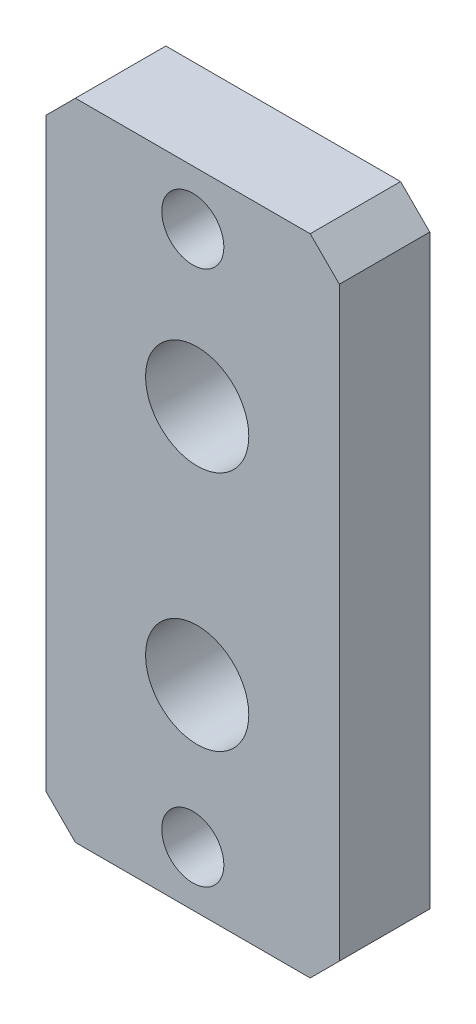
ISO-10303-21;
HEADER;
FILE_DESCRIPTION(('STEP AP214'),'2;1');
FILE_NAME('part.step','',(''),(''),'','','');
FILE_SCHEMA(('AUTOMOTIVE_DESIGN { 1 0 10303 214 1 1 1 1 }'));
ENDSEC;
DATA;
#1=APPLICATION_CONTEXT('core data for automotive mechanical design processes');
#2=APPLICATION_PROTOCOL_DEFINITION('international standard','automotive_design',2000,#1);
#3=PRODUCT_CONTEXT('',#1,'mechanical');
#4=PRODUCT('Part','Part','',(#3));
#5=PRODUCT_RELATED_PRODUCT_CATEGORY('part','',(#4));
#6=PRODUCT_DEFINITION_FORMATION('','',#4);
#7=PRODUCT_DEFINITION_CONTEXT('part definition',#1,'design');
#8=PRODUCT_DEFINITION('design','',#6,#7);
#9=PRODUCT_DEFINITION_SHAPE('','',#8);
#10=(LENGTH_UNIT() NAMED_UNIT(*) SI_UNIT(.MILLI.,.METRE.));
#11=(NAMED_UNIT(*) PLANE_ANGLE_UNIT() SI_UNIT($,.RADIAN.));
#12=(NAMED_UNIT(*) SI_UNIT($,.STERADIAN.) SOLID_ANGLE_UNIT());
#13=UNCERTAINTY_MEASURE_WITH_UNIT(LENGTH_MEASURE(1.E-05),#10,'distance_accuracy_value','');
#14=(GEOMETRIC_REPRESENTATION_CONTEXT(3) GLOBAL_UNCERTAINTY_ASSIGNED_CONTEXT((#13)) GLOBAL_UNIT_ASSIGNED_CONTEXT((#10,
#11,#12)) REPRESENTATION_CONTEXT('',''));
#15=CARTESIAN_POINT('',(0.,0.,0.));
#16=DIRECTION('',(0.,0.,1.));
#17=DIRECTION('',(1.,0.,0.));
#18=AXIS2_PLACEMENT_3D('',#15,#16,#17);
#19=CARTESIAN_POINT('',(0.,0.,0.));
#20=DIRECTION('',(0.,0.,1.));
#21=DIRECTION('',(1.,0.,0.));
#22=AXIS2_PLACEMENT_3D('',#19,#20,#21);
#23=PLANE('',#22);
#24=CARTESIAN_POINT('',(-14.4791443507042,46.9403076965016,0.));
#25=DIRECTION('',(0.,0.,-1.));
#26=DIRECTION('',(-1.,0.,0.));
#27=AXIS2_PLACEMENT_3D('',#24,#25,#26);
#28=CIRCLE('',#27,2.24789999999999);
#29=CARTESIAN_POINT('',(-16.7270443507042,46.9403076965016,0.));
#30=VERTEX_POINT('',#29);
#31=EDGE_CURVE('E366',#30,#30,#28,.T.);
#32=ORIENTED_EDGE('',*,*,#31,.F.);
#33=EDGE_LOOP('',(#32));
#34=FACE_BOUND('',#33,.T.);
#35=DIRECTION('',(0.,1.,0.));
#36=VECTOR('',#35,1.);
#37=CARTESIAN_POINT('',(-9.0498943507042,33.1156969127037,0.));
#38=LINE('',#37,#36);
#39=CARTESIAN_POINT('',(-9.0498943507042,33.1156969127037,0.));
#40=VERTEX_POINT('',#39);
#41=CARTESIAN_POINT('',(-9.0498943507042,50.6416969127035,0.));
#42=VERTEX_POINT('',#41);
#43=EDGE_CURVE('E148',#40,#42,#38,.T.);
#44=ORIENTED_EDGE('',*,*,#43,.F.);
#45=CARTESIAN_POINT('',(-9.5578943507042,33.1156969127037,0.));
#46=DIRECTION('',(0.,0.,1.));
#47=DIRECTION('',(1.,0.,0.));
#48=AXIS2_PLACEMENT_3D('',#45,#46,#47);
#49=CIRCLE('',#48,0.507999999999998);
#50=CARTESIAN_POINT('',(-9.5578943507042,32.6076969127037,0.));
#51=VERTEX_POINT('',#50);
#52=EDGE_CURVE('E168',#51,#40,#49,.T.);
#53=ORIENTED_EDGE('',*,*,#52,.F.);
#54=DIRECTION('',(1.,0.,0.));
#55=VECTOR('',#54,1.);
#56=CARTESIAN_POINT('',(-19.7813943507042,32.6076969127037,0.));
#57=LINE('',#56,#55);
#58=CARTESIAN_POINT('',(-19.7813943507042,32.6076969127037,0.));
#59=VERTEX_POINT('',#58);
#60=EDGE_CURVE('E184',#59,#51,#57,.T.);
#61=ORIENTED_EDGE('',*,*,#60,.F.);
#62=CARTESIAN_POINT('',(-19.7813943507042,33.1156969127037,0.));
#63=DIRECTION('',(0.,0.,1.));
#64=DIRECTION('',(1.,0.,0.));
#65=AXIS2_PLACEMENT_3D('',#62,#63,#64);
#66=CIRCLE('',#65,0.508000000000002);
#67=CARTESIAN_POINT('',(-20.2893943507042,33.1156969127037,0.));
#68=VERTEX_POINT('',#67);
#69=EDGE_CURVE('E181',#68,#59,#66,.T.);
#70=ORIENTED_EDGE('',*,*,#69,.F.);
#71=DIRECTION('',(0.,-1.,0.));
#72=VECTOR('',#71,1.);
#73=CARTESIAN_POINT('',(-20.2893943507042,50.6416969127035,0.));
#74=LINE('',#73,#72);
#75=CARTESIAN_POINT('',(-20.2893943507042,50.6416969127035,0.));
#76=VERTEX_POINT('',#75);
#77=EDGE_CURVE('E178',#76,#68,#74,.T.);
#78=ORIENTED_EDGE('',*,*,#77,.F.);
#79=CARTESIAN_POINT('',(-19.7813943507042,50.6416969127035,0.));
#80=DIRECTION('',(0.,0.,1.));
#81=DIRECTION('',(1.,0.,0.));
#82=AXIS2_PLACEMENT_3D('',#79,#80,#81);
#83=CIRCLE('',#82,0.507999999999996);
#84=CARTESIAN_POINT('',(-19.7813943507042,51.1496969127035,0.));
#85=VERTEX_POINT('',#84);
#86=EDGE_CURVE('E175',#85,#76,#83,.T.);
#87=ORIENTED_EDGE('',*,*,#86,.F.);
#88=DIRECTION('',(-1.,0.,0.));
#89=VECTOR('',#88,1.);
#90=CARTESIAN_POINT('',(-9.5578943507042,51.1496969127035,0.));
#91=LINE('',#90,#89);
#92=CARTESIAN_POINT('',(-9.5578943507042,51.1496969127035,0.));
#93=VERTEX_POINT('',#92);
#94=EDGE_CURVE('E151',#93,#85,#91,.T.);
#95=ORIENTED_EDGE('',*,*,#94,.F.);
#96=CARTESIAN_POINT('',(-9.5578943507042,50.6416969127035,0.));
#97=DIRECTION('',(0.,0.,1.));
#98=DIRECTION('',(1.,0.,0.));
#99=AXIS2_PLACEMENT_3D('',#96,#97,#98);
#100=CIRCLE('',#99,0.508000000000001);
#101=EDGE_CURVE('E144',#42,#93,#100,.T.);
#102=ORIENTED_EDGE('',*,*,#101,.F.);
#103=EDGE_LOOP('',(#44,#53,#61,#70,#78,#87,#95,#102));
#104=FACE_BOUND('',#103,.T.);
#105=CARTESIAN_POINT('',(-14.4791443507042,36.4360861289058,0.));
#106=DIRECTION('',(0.,0.,-1.));
#107=DIRECTION('',(-1.,0.,0.));
#108=AXIS2_PLACEMENT_3D('',#105,#106,#107);
#109=CIRCLE('',#108,2.24789999999999);
#110=CARTESIAN_POINT('',(-16.7270443507042,36.4360861289058,0.));
#111=VERTEX_POINT('',#110);
#112=EDGE_CURVE('E362',#111,#111,#109,.T.);
#113=ORIENTED_EDGE('',*,*,#112,.F.);
#114=EDGE_LOOP('',(#113));
#115=FACE_BOUND('',#114,.T.);
#116=ADVANCED_FACE('F32',(#34,#104,#115),#23,.F.);
#117=CARTESIAN_POINT('',(-8.2878943507042,27.8451969127037,-0.762));
#118=DIRECTION('',(1.,0.,0.));
#119=DIRECTION('',(0.,1.,0.));
#120=AXIS2_PLACEMENT_3D('',#117,#118,#119);
#121=PLANE('',#120);
#122=DIRECTION('',(0.,1.,0.));
#123=VECTOR('',#122,1.);
#124=CARTESIAN_POINT('',(-8.2878943507042,27.8451969127037,-0.762));
#125=LINE('',#124,#123);
#126=CARTESIAN_POINT('',(-8.2878943507042,29.1151969127037,-0.762));
#127=VERTEX_POINT('',#126);
#128=CARTESIAN_POINT('',(-8.2878943507042,54.6421974914117,-0.762));
#129=VERTEX_POINT('',#128);
#130=EDGE_CURVE('E191',#127,#129,#125,.T.);
#131=ORIENTED_EDGE('',*,*,#130,.T.);
#132=DIRECTION('',(0.,0.,1.));
#133=VECTOR('',#132,1.);
#134=CARTESIAN_POINT('',(-8.2878943507042,54.6421974914117,-0.762));
#135=LINE('',#134,#133);
#136=CARTESIAN_POINT('',(-8.2878943507042,54.6421974914117,3.175));
#137=VERTEX_POINT('',#136);
#138=EDGE_CURVE('E244',#129,#137,#135,.T.);
#139=ORIENTED_EDGE('',*,*,#138,.T.);
#140=DIRECTION('',(0.,1.,0.));
#141=VECTOR('',#140,1.);
#142=CARTESIAN_POINT('',(-8.2878943507042,27.8451969127037,3.175));
#143=LINE('',#142,#141);
#144=CARTESIAN_POINT('',(-8.2878943507042,29.1151969127037,3.175));
#145=VERTEX_POINT('',#144);
#146=EDGE_CURVE('E258',#145,#137,#143,.T.);
#147=ORIENTED_EDGE('',*,*,#146,.F.);
#148=DIRECTION('',(0.,0.,-1.));
#149=VECTOR('',#148,1.);
#150=CARTESIAN_POINT('',(-8.2878943507042,29.1151969127037,-0.762));
#151=LINE('',#150,#149);
#152=EDGE_CURVE('E242',#145,#127,#151,.T.);
#153=ORIENTED_EDGE('',*,*,#152,.T.);
#154=EDGE_LOOP('',(#131,#139,#147,#153));
#155=FACE_BOUND('',#154,.T.);
#156=ADVANCED_FACE('F316',(#155),#121,.T.);
#157=CARTESIAN_POINT('',(-21.0513943507042,27.8451969127037,-0.762));
#158=DIRECTION('',(0.,-1.,0.));
#159=DIRECTION('',(0.,0.,-1.));
#160=AXIS2_PLACEMENT_3D('',#157,#158,#159);
#161=PLANE('',#160);
#162=DIRECTION('',(1.,0.,0.));
#163=VECTOR('',#162,1.);
#164=CARTESIAN_POINT('',(-21.0513943507042,27.8451969127037,3.175));
#165=LINE('',#164,#163);
#166=CARTESIAN_POINT('',(-19.7813943507042,27.8451969127037,3.175));
#167=VERTEX_POINT('',#166);
#168=CARTESIAN_POINT('',(-9.5578943507042,27.8451969127037,3.175));
#169=VERTEX_POINT('',#168);
#170=EDGE_CURVE('E250',#167,#169,#165,.T.);
#171=ORIENTED_EDGE('',*,*,#170,.F.);
#172=DIRECTION('',(0.,0.,-1.));
#173=VECTOR('',#172,1.);
#174=CARTESIAN_POINT('',(-19.7813943507042,27.8451969127037,-0.762));
#175=LINE('',#174,#173);
#176=CARTESIAN_POINT('',(-19.7813943507042,27.8451969127037,-0.762));
#177=VERTEX_POINT('',#176);
#178=EDGE_CURVE('E11',#167,#177,#175,.T.);
#179=ORIENTED_EDGE('',*,*,#178,.T.);
#180=DIRECTION('',(1.,0.,0.));
#181=VECTOR('',#180,1.);
#182=CARTESIAN_POINT('',(-21.0513943507042,27.8451969127037,-0.762));
#183=LINE('',#182,#181);
#184=CARTESIAN_POINT('',(-9.5578943507042,27.8451969127037,-0.762));
#185=VERTEX_POINT('',#184);
#186=EDGE_CURVE('E215',#177,#185,#183,.T.);
#187=ORIENTED_EDGE('',*,*,#186,.T.);
#188=DIRECTION('',(0.,0.,1.));
#189=VECTOR('',#188,1.);
#190=CARTESIAN_POINT('',(-9.5578943507042,27.8451969127037,-0.762));
#191=LINE('',#190,#189);
#192=EDGE_CURVE('E40',#185,#169,#191,.T.);
#193=ORIENTED_EDGE('',*,*,#192,.T.);
#194=EDGE_LOOP('',(#171,#179,#187,#193));
#195=FACE_BOUND('',#194,.T.);
#196=ADVANCED_FACE('F249',(#195),#161,.T.);
#197=CARTESIAN_POINT('',(-21.0513943507042,27.8451969127037,-0.762));
#198=DIRECTION('',(-1.,0.,0.));
#199=DIRECTION('',(0.,0.,1.));
#200=AXIS2_PLACEMENT_3D('',#197,#198,#199);
#201=PLANE('',#200);
#202=DIRECTION('',(0.,-1.,0.));
#203=VECTOR('',#202,1.);
#204=CARTESIAN_POINT('',(-21.0513943507042,55.9121974914117,3.175));
#205=LINE('',#204,#203);
#206=CARTESIAN_POINT('',(-21.0513943507042,54.6421974914117,3.175));
#207=VERTEX_POINT('',#206);
#208=CARTESIAN_POINT('',(-21.0513943507042,29.1151969127037,3.175));
#209=VERTEX_POINT('',#208);
#210=EDGE_CURVE('E170',#207,#209,#205,.T.);
#211=ORIENTED_EDGE('',*,*,#210,.F.);
#212=DIRECTION('',(0.,0.,-1.));
#213=VECTOR('',#212,1.);
#214=CARTESIAN_POINT('',(-21.0513943507042,54.6421974914117,-0.762));
#215=LINE('',#214,#213);
#216=CARTESIAN_POINT('',(-21.0513943507042,54.6421974914117,-0.762));
#217=VERTEX_POINT('',#216);
#218=EDGE_CURVE('E233',#207,#217,#215,.T.);
#219=ORIENTED_EDGE('',*,*,#218,.T.);
#220=DIRECTION('',(0.,-1.,0.));
#221=VECTOR('',#220,1.);
#222=CARTESIAN_POINT('',(-21.0513943507042,27.8451969127037,-0.762));
#223=LINE('',#222,#221);
#224=CARTESIAN_POINT('',(-21.0513943507042,29.1151969127037,-0.762));
#225=VERTEX_POINT('',#224);
#226=EDGE_CURVE('E212',#217,#225,#223,.T.);
#227=ORIENTED_EDGE('',*,*,#226,.T.);
#228=DIRECTION('',(0.,0.,1.));
#229=VECTOR('',#228,1.);
#230=CARTESIAN_POINT('',(-21.0513943507042,29.1151969127037,-0.762));
#231=LINE('',#230,#229);
#232=EDGE_CURVE('E230',#225,#209,#231,.T.);
#233=ORIENTED_EDGE('',*,*,#232,.T.);
#234=EDGE_LOOP('',(#211,#219,#227,#233));
#235=FACE_BOUND('',#234,.T.);
#236=ADVANCED_FACE('F401',(#235),#201,.T.);
#237=CARTESIAN_POINT('',(-21.0513943507042,55.9121974914117,-0.762));
#238=DIRECTION('',(0.,1.,0.));
#239=DIRECTION('',(0.,0.,1.));
#240=AXIS2_PLACEMENT_3D('',#237,#238,#239);
#241=PLANE('',#240);
#242=DIRECTION('',(-1.,0.,0.));
#243=VECTOR('',#242,1.);
#244=CARTESIAN_POINT('',(-21.0513943507042,55.9121974914117,-0.762));
#245=LINE('',#244,#243);
#246=CARTESIAN_POINT('',(-9.5578943507042,55.9121974914117,-0.762));
#247=VERTEX_POINT('',#246);
#248=CARTESIAN_POINT('',(-19.7813943507042,55.9121974914117,-0.762));
#249=VERTEX_POINT('',#248);
#250=EDGE_CURVE('E209',#247,#249,#245,.T.);
#251=ORIENTED_EDGE('',*,*,#250,.T.);
#252=DIRECTION('',(0.,0.,1.));
#253=VECTOR('',#252,1.);
#254=CARTESIAN_POINT('',(-19.7813943507042,55.9121974914117,-0.762));
#255=LINE('',#254,#253);
#256=CARTESIAN_POINT('',(-19.7813943507042,55.9121974914117,3.175));
#257=VERTEX_POINT('',#256);
#258=EDGE_CURVE('E219',#249,#257,#255,.T.);
#259=ORIENTED_EDGE('',*,*,#258,.T.);
#260=DIRECTION('',(-1.,0.,0.));
#261=VECTOR('',#260,1.);
#262=CARTESIAN_POINT('',(-8.2878943507042,55.9121974914117,3.175));
#263=LINE('',#262,#261);
#264=CARTESIAN_POINT('',(-9.5578943507042,55.9121974914117,3.175));
#265=VERTEX_POINT('',#264);
#266=EDGE_CURVE('E261',#265,#257,#263,.T.);
#267=ORIENTED_EDGE('',*,*,#266,.F.);
#268=DIRECTION('',(0.,0.,-1.));
#269=VECTOR('',#268,1.);
#270=CARTESIAN_POINT('',(-9.5578943507042,55.9121974914117,-0.762));
#271=LINE('',#270,#269);
#272=EDGE_CURVE('E217',#265,#247,#271,.T.);
#273=ORIENTED_EDGE('',*,*,#272,.T.);
#274=EDGE_LOOP('',(#251,#259,#267,#273));
#275=FACE_BOUND('',#274,.T.);
#276=ADVANCED_FACE('F393',(#275),#241,.T.);
#277=CARTESIAN_POINT('',(0.,0.,-0.762));
#278=DIRECTION('',(0.,0.,-1.));
#279=DIRECTION('',(-1.,0.,0.));
#280=AXIS2_PLACEMENT_3D('',#277,#278,#279);
#281=PLANE('',#280);
#282=CARTESIAN_POINT('',(-14.6696443507042,30.2264469127037,-0.762));
#283=DIRECTION('',(0.,0.,-1.));
#284=DIRECTION('',(-1.,0.,0.));
#285=AXIS2_PLACEMENT_3D('',#282,#283,#284);
#286=CIRCLE('',#285,2.1844);
#287=CARTESIAN_POINT('',(-16.8540443507042,30.2264469127037,-0.762));
#288=VERTEX_POINT('',#287);
#289=EDGE_CURVE('E375',#288,#288,#286,.T.);
#290=ORIENTED_EDGE('',*,*,#289,.F.);
#291=EDGE_LOOP('',(#290));
#292=FACE_BOUND('',#291,.T.);
#293=CARTESIAN_POINT('',(-14.6696443507042,53.5309474914117,-0.762));
#294=DIRECTION('',(0.,0.,-1.));
#295=DIRECTION('',(-1.,0.,0.));
#296=AXIS2_PLACEMENT_3D('',#293,#294,#295);
#297=CIRCLE('',#296,2.1844);
#298=CARTESIAN_POINT('',(-16.8540443507042,53.5309474914117,-0.762));
#299=VERTEX_POINT('',#298);
#300=EDGE_CURVE('E384',#299,#299,#297,.T.);
#301=ORIENTED_EDGE('',*,*,#300,.F.);
#302=EDGE_LOOP('',(#301));
#303=FACE_BOUND('',#302,.T.);
#304=CARTESIAN_POINT('',(-9.5578943507042,33.1156969127037,-0.762));
#305=DIRECTION('',(0.,0.,1.));
#306=DIRECTION('',(1.,0.,0.));
#307=AXIS2_PLACEMENT_3D('',#304,#305,#306);
#308=CIRCLE('',#307,0.507999999999998);
#309=CARTESIAN_POINT('',(-9.5578943507042,32.6076969127037,-0.762));
#310=VERTEX_POINT('',#309);
#311=CARTESIAN_POINT('',(-9.0498943507042,33.1156969127037,-0.762));
#312=VERTEX_POINT('',#311);
#313=EDGE_CURVE('E187',#310,#312,#308,.T.);
#314=ORIENTED_EDGE('',*,*,#313,.T.);
#315=DIRECTION('',(0.,1.,0.));
#316=VECTOR('',#315,1.);
#317=CARTESIAN_POINT('',(-9.0498943507042,33.1156969127037,-0.762));
#318=LINE('',#317,#316);
#319=CARTESIAN_POINT('',(-9.0498943507042,50.6416969127035,-0.762));
#320=VERTEX_POINT('',#319);
#321=EDGE_CURVE('E272',#312,#320,#318,.T.);
#322=ORIENTED_EDGE('',*,*,#321,.T.);
#323=CARTESIAN_POINT('',(-9.5578943507042,50.6416969127035,-0.762));
#324=DIRECTION('',(0.,0.,1.));
#325=DIRECTION('',(1.,0.,0.));
#326=AXIS2_PLACEMENT_3D('',#323,#324,#325);
#327=CIRCLE('',#326,0.508000000000001);
#328=CARTESIAN_POINT('',(-9.5578943507042,51.1496969127035,-0.762));
#329=VERTEX_POINT('',#328);
#330=EDGE_CURVE('E159',#320,#329,#327,.T.);
#331=ORIENTED_EDGE('',*,*,#330,.T.);
#332=DIRECTION('',(-1.,0.,0.));
#333=VECTOR('',#332,1.);
#334=CARTESIAN_POINT('',(-9.5578943507042,51.1496969127035,-0.762));
#335=LINE('',#334,#333);
#336=CARTESIAN_POINT('',(-19.7813943507042,51.1496969127035,-0.762));
#337=VERTEX_POINT('',#336);
#338=EDGE_CURVE('E275',#329,#337,#335,.T.);
#339=ORIENTED_EDGE('',*,*,#338,.T.);
#340=CARTESIAN_POINT('',(-19.7813943507042,50.6416969127035,-0.762));
#341=DIRECTION('',(0.,0.,1.));
#342=DIRECTION('',(1.,0.,0.));
#343=AXIS2_PLACEMENT_3D('',#340,#341,#342);
#344=CIRCLE('',#343,0.507999999999996);
#345=CARTESIAN_POINT('',(-20.2893943507042,50.6416969127035,-0.762));
#346=VERTEX_POINT('',#345);
#347=EDGE_CURVE('E278',#337,#346,#344,.T.);
#348=ORIENTED_EDGE('',*,*,#347,.T.);
#349=DIRECTION('',(0.,-1.,0.));
#350=VECTOR('',#349,1.);
#351=CARTESIAN_POINT('',(-20.2893943507042,50.6416969127035,-0.762));
#352=LINE('',#351,#350);
#353=CARTESIAN_POINT('',(-20.2893943507042,33.1156969127037,-0.762));
#354=VERTEX_POINT('',#353);
#355=EDGE_CURVE('E281',#346,#354,#352,.T.);
#356=ORIENTED_EDGE('',*,*,#355,.T.);
#357=CARTESIAN_POINT('',(-19.7813943507042,33.1156969127037,-0.762));
#358=DIRECTION('',(0.,0.,1.));
#359=DIRECTION('',(1.,0.,0.));
#360=AXIS2_PLACEMENT_3D('',#357,#358,#359);
#361=CIRCLE('',#360,0.508000000000002);
#362=CARTESIAN_POINT('',(-19.7813943507042,32.6076969127037,-0.762));
#363=VERTEX_POINT('',#362);
#364=EDGE_CURVE('E284',#354,#363,#361,.T.);
#365=ORIENTED_EDGE('',*,*,#364,.T.);
#366=DIRECTION('',(1.,0.,0.));
#367=VECTOR('',#366,1.);
#368=CARTESIAN_POINT('',(-19.7813943507042,32.6076969127037,-0.762));
#369=LINE('',#368,#367);
#370=EDGE_CURVE('E206',#363,#310,#369,.T.);
#371=ORIENTED_EDGE('',*,*,#370,.T.);
#372=EDGE_LOOP('',(#314,#322,#331,#339,#348,#356,#365,#371));
#373=FACE_BOUND('',#372,.T.);
#374=ORIENTED_EDGE('',*,*,#226,.F.);
#375=DIRECTION('',(-0.707106781186547,-0.707106781186549,0.));
#376=VECTOR('',#375,1.);
#377=CARTESIAN_POINT('',(-37.846795921058,37.8467959210579,-0.762));
#378=LINE('',#377,#376);
#379=EDGE_CURVE('E240',#217,#249,#378,.F.);
#380=ORIENTED_EDGE('',*,*,#379,.T.);
#381=ORIENTED_EDGE('',*,*,#250,.F.);
#382=DIRECTION('',(-0.707106781186551,0.707106781186544,0.));
#383=VECTOR('',#382,1.);
#384=CARTESIAN_POINT('',(23.1771515703538,23.177151570354,-0.762));
#385=LINE('',#384,#383);
#386=EDGE_CURVE('E238',#247,#129,#385,.F.);
#387=ORIENTED_EDGE('',*,*,#386,.T.);
#388=ORIENTED_EDGE('',*,*,#130,.F.);
#389=DIRECTION('',(0.707106781186547,0.707106781186548,0.));
#390=VECTOR('',#389,1.);
#391=CARTESIAN_POINT('',(-18.701545631704,18.7015456317039,-0.762));
#392=LINE('',#391,#390);
#393=EDGE_CURVE('E47',#127,#185,#392,.F.);
#394=ORIENTED_EDGE('',*,*,#393,.T.);
#395=ORIENTED_EDGE('',*,*,#186,.F.);
#396=DIRECTION('',(0.707106781186548,-0.707106781186547,0.));
#397=VECTOR('',#396,1.);
#398=CARTESIAN_POINT('',(4.03190128099978,4.03190128099979,-0.762));
#399=LINE('',#398,#397);
#400=EDGE_CURVE('E236',#177,#225,#399,.F.);
#401=ORIENTED_EDGE('',*,*,#400,.T.);
#402=EDGE_LOOP('',(#374,#380,#381,#387,#388,#394,#395,#401));
#403=FACE_BOUND('',#402,.T.);
#404=ADVANCED_FACE('F289',(#292,#303,#373,#403),#281,.T.);
#405=CARTESIAN_POINT('',(-9.5578943507042,33.1156969127037,-0.762));
#406=DIRECTION('',(0.,0.,1.));
#407=DIRECTION('',(1.,0.,0.));
#408=AXIS2_PLACEMENT_3D('',#405,#406,#407);
#409=CYLINDRICAL_SURFACE('',#408,0.507999999999998);
#410=ORIENTED_EDGE('',*,*,#52,.T.);
#411=DIRECTION('',(0.,0.,1.));
#412=VECTOR('',#411,1.);
#413=CARTESIAN_POINT('',(-9.0498943507042,33.1156969127037,-0.762));
#414=LINE('',#413,#412);
#415=EDGE_CURVE('E164',#312,#40,#414,.T.);
#416=ORIENTED_EDGE('',*,*,#415,.F.);
#417=ORIENTED_EDGE('',*,*,#313,.F.);
#418=DIRECTION('',(0.,0.,1.));
#419=VECTOR('',#418,1.);
#420=CARTESIAN_POINT('',(-9.5578943507042,32.6076969127037,-0.762));
#421=LINE('',#420,#419);
#422=EDGE_CURVE('E188',#310,#51,#421,.T.);
#423=ORIENTED_EDGE('',*,*,#422,.T.);
#424=EDGE_LOOP('',(#410,#416,#417,#423));
#425=FACE_BOUND('',#424,.T.);
#426=ADVANCED_FACE('F295',(#425),#409,.F.);
#427=CARTESIAN_POINT('',(-19.7813943507042,32.6076969127037,-0.762));
#428=DIRECTION('',(0.,-1.,0.));
#429=DIRECTION('',(1.,0.,0.));
#430=AXIS2_PLACEMENT_3D('',#427,#428,#429);
#431=PLANE('',#430);
#432=ORIENTED_EDGE('',*,*,#60,.T.);
#433=ORIENTED_EDGE('',*,*,#422,.F.);
#434=ORIENTED_EDGE('',*,*,#370,.F.);
#435=DIRECTION('',(0.,0.,1.));
#436=VECTOR('',#435,1.);
#437=CARTESIAN_POINT('',(-19.7813943507042,32.6076969127037,-0.762));
#438=LINE('',#437,#436);
#439=EDGE_CURVE('E192',#363,#59,#438,.T.);
#440=ORIENTED_EDGE('',*,*,#439,.T.);
#441=EDGE_LOOP('',(#432,#433,#434,#440));
#442=FACE_BOUND('',#441,.T.);
#443=ADVANCED_FACE('F293',(#442),#431,.F.);
#444=CARTESIAN_POINT('',(-19.7813943507042,33.1156969127037,-0.762));
#445=DIRECTION('',(0.,0.,1.));
#446=DIRECTION('',(1.,0.,0.));
#447=AXIS2_PLACEMENT_3D('',#444,#445,#446);
#448=CYLINDRICAL_SURFACE('',#447,0.508000000000002);
#449=ORIENTED_EDGE('',*,*,#69,.T.);
#450=ORIENTED_EDGE('',*,*,#439,.F.);
#451=ORIENTED_EDGE('',*,*,#364,.F.);
#452=DIRECTION('',(0.,0.,1.));
#453=VECTOR('',#452,1.);
#454=CARTESIAN_POINT('',(-20.2893943507042,33.1156969127037,-0.762));
#455=LINE('',#454,#453);
#456=EDGE_CURVE('E195',#354,#68,#455,.T.);
#457=ORIENTED_EDGE('',*,*,#456,.T.);
#458=EDGE_LOOP('',(#449,#450,#451,#457));
#459=FACE_BOUND('',#458,.T.);
#460=ADVANCED_FACE('F306',(#459),#448,.F.);
#461=CARTESIAN_POINT('',(-20.2893943507042,50.6416969127035,-0.762));
#462=DIRECTION('',(-1.,0.,0.));
#463=DIRECTION('',(0.,-1.,0.));
#464=AXIS2_PLACEMENT_3D('',#461,#462,#463);
#465=PLANE('',#464);
#466=ORIENTED_EDGE('',*,*,#77,.T.);
#467=ORIENTED_EDGE('',*,*,#456,.F.);
#468=ORIENTED_EDGE('',*,*,#355,.F.);
#469=DIRECTION('',(0.,0.,1.));
#470=VECTOR('',#469,1.);
#471=CARTESIAN_POINT('',(-20.2893943507042,50.6416969127035,-0.762));
#472=LINE('',#471,#470);
#473=EDGE_CURVE('E198',#346,#76,#472,.T.);
#474=ORIENTED_EDGE('',*,*,#473,.T.);
#475=EDGE_LOOP('',(#466,#467,#468,#474));
#476=FACE_BOUND('',#475,.T.);
#477=ADVANCED_FACE('F304',(#476),#465,.F.);
#478=CARTESIAN_POINT('',(-19.7813943507042,50.6416969127035,-0.762));
#479=DIRECTION('',(0.,0.,1.));
#480=DIRECTION('',(1.,0.,0.));
#481=AXIS2_PLACEMENT_3D('',#478,#479,#480);
#482=CYLINDRICAL_SURFACE('',#481,0.507999999999996);
#483=ORIENTED_EDGE('',*,*,#86,.T.);
#484=ORIENTED_EDGE('',*,*,#473,.F.);
#485=ORIENTED_EDGE('',*,*,#347,.F.);
#486=DIRECTION('',(0.,0.,1.));
#487=VECTOR('',#486,1.);
#488=CARTESIAN_POINT('',(-19.7813943507042,51.1496969127035,-0.762));
#489=LINE('',#488,#487);
#490=EDGE_CURVE('E201',#337,#85,#489,.T.);
#491=ORIENTED_EDGE('',*,*,#490,.T.);
#492=EDGE_LOOP('',(#483,#484,#485,#491));
#493=FACE_BOUND('',#492,.T.);
#494=ADVANCED_FACE('F301',(#493),#482,.F.);
#495=CARTESIAN_POINT('',(-9.5578943507042,51.1496969127035,-0.762));
#496=DIRECTION('',(0.,1.,0.));
#497=DIRECTION('',(-1.,0.,0.));
#498=AXIS2_PLACEMENT_3D('',#495,#496,#497);
#499=PLANE('',#498);
#500=ORIENTED_EDGE('',*,*,#94,.T.);
#501=ORIENTED_EDGE('',*,*,#490,.F.);
#502=ORIENTED_EDGE('',*,*,#338,.F.);
#503=DIRECTION('',(0.,0.,1.));
#504=VECTOR('',#503,1.);
#505=CARTESIAN_POINT('',(-9.5578943507042,51.1496969127035,-0.762));
#506=LINE('',#505,#504);
#507=EDGE_CURVE('E163',#329,#93,#506,.T.);
#508=ORIENTED_EDGE('',*,*,#507,.T.);
#509=EDGE_LOOP('',(#500,#501,#502,#508));
#510=FACE_BOUND('',#509,.T.);
#511=ADVANCED_FACE('F299',(#510),#499,.F.);
#512=CARTESIAN_POINT('',(-9.5578943507042,50.6416969127035,-0.762));
#513=DIRECTION('',(0.,0.,1.));
#514=DIRECTION('',(1.,0.,0.));
#515=AXIS2_PLACEMENT_3D('',#512,#513,#514);
#516=CYLINDRICAL_SURFACE('',#515,0.508000000000001);
#517=ORIENTED_EDGE('',*,*,#101,.T.);
#518=ORIENTED_EDGE('',*,*,#507,.F.);
#519=ORIENTED_EDGE('',*,*,#330,.F.);
#520=DIRECTION('',(0.,0.,1.));
#521=VECTOR('',#520,1.);
#522=CARTESIAN_POINT('',(-9.0498943507042,50.6416969127035,-0.762));
#523=LINE('',#522,#521);
#524=EDGE_CURVE('E156',#320,#42,#523,.T.);
#525=ORIENTED_EDGE('',*,*,#524,.T.);
#526=EDGE_LOOP('',(#517,#518,#519,#525));
#527=FACE_BOUND('',#526,.T.);
#528=ADVANCED_FACE('F157',(#527),#516,.F.);
#529=CARTESIAN_POINT('',(-9.0498943507042,33.1156969127037,-0.762));
#530=DIRECTION('',(1.,0.,0.));
#531=DIRECTION('',(0.,0.,-1.));
#532=AXIS2_PLACEMENT_3D('',#529,#530,#531);
#533=PLANE('',#532);
#534=ORIENTED_EDGE('',*,*,#43,.T.);
#535=ORIENTED_EDGE('',*,*,#524,.F.);
#536=ORIENTED_EDGE('',*,*,#321,.F.);
#537=ORIENTED_EDGE('',*,*,#415,.T.);
#538=EDGE_LOOP('',(#534,#535,#536,#537));
#539=FACE_BOUND('',#538,.T.);
#540=ADVANCED_FACE('F167',(#539),#533,.F.);
#541=CARTESIAN_POINT('',(0.,0.,3.175));
#542=DIRECTION('',(0.,0.,1.));
#543=DIRECTION('',(1.,0.,0.));
#544=AXIS2_PLACEMENT_3D('',#541,#542,#543);
#545=PLANE('',#544);
#546=CARTESIAN_POINT('',(-14.4791443507042,36.4360861289058,3.175));
#547=DIRECTION('',(0.,0.,1.));
#548=DIRECTION('',(1.,0.,0.));
#549=AXIS2_PLACEMENT_3D('',#546,#547,#548);
#550=CIRCLE('',#549,2.24789999999999);
#551=CARTESIAN_POINT('',(-12.2312443507042,36.4360861289058,3.175));
#552=VERTEX_POINT('',#551);
#553=EDGE_CURVE('E365',#552,#552,#550,.T.);
#554=ORIENTED_EDGE('',*,*,#553,.F.);
#555=EDGE_LOOP('',(#554));
#556=FACE_BOUND('',#555,.T.);
#557=CARTESIAN_POINT('',(-14.4791443507042,46.9403076965016,3.175));
#558=DIRECTION('',(0.,0.,1.));
#559=DIRECTION('',(1.,0.,0.));
#560=AXIS2_PLACEMENT_3D('',#557,#558,#559);
#561=CIRCLE('',#560,2.24789999999999);
#562=CARTESIAN_POINT('',(-12.2312443507042,46.9403076965016,3.175));
#563=VERTEX_POINT('',#562);
#564=EDGE_CURVE('E369',#563,#563,#561,.T.);
#565=ORIENTED_EDGE('',*,*,#564,.F.);
#566=EDGE_LOOP('',(#565));
#567=FACE_BOUND('',#566,.T.);
#568=CARTESIAN_POINT('',(-14.6696443507042,30.2264469127037,3.175));
#569=DIRECTION('',(0.,0.,1.));
#570=DIRECTION('',(1.,0.,0.));
#571=AXIS2_PLACEMENT_3D('',#568,#569,#570);
#572=CIRCLE('',#571,1.35255);
#573=CARTESIAN_POINT('',(-13.3170943507042,30.2264469127037,3.175));
#574=VERTEX_POINT('',#573);
#575=EDGE_CURVE('E381',#574,#574,#572,.T.);
#576=ORIENTED_EDGE('',*,*,#575,.F.);
#577=EDGE_LOOP('',(#576));
#578=FACE_BOUND('',#577,.T.);
#579=CARTESIAN_POINT('',(-14.6696443507042,53.5309474914117,3.175));
#580=DIRECTION('',(0.,0.,1.));
#581=DIRECTION('',(1.,0.,0.));
#582=AXIS2_PLACEMENT_3D('',#579,#580,#581);
#583=CIRCLE('',#582,1.35255);
#584=CARTESIAN_POINT('',(-13.3170943507042,53.5309474914117,3.175));
#585=VERTEX_POINT('',#584);
#586=EDGE_CURVE('E259',#585,#585,#583,.T.);
#587=ORIENTED_EDGE('',*,*,#586,.F.);
#588=EDGE_LOOP('',(#587));
#589=FACE_BOUND('',#588,.T.);
#590=ORIENTED_EDGE('',*,*,#266,.T.);
#591=DIRECTION('',(0.707106781186547,0.707106781186549,0.));
#592=VECTOR('',#591,1.);
#593=CARTESIAN_POINT('',(-37.846795921058,37.8467959210579,3.175));
#594=LINE('',#593,#592);
#595=EDGE_CURVE('E228',#257,#207,#594,.F.);
#596=ORIENTED_EDGE('',*,*,#595,.T.);
#597=ORIENTED_EDGE('',*,*,#210,.T.);
#598=DIRECTION('',(-0.707106781186548,0.707106781186547,0.));
#599=VECTOR('',#598,1.);
#600=CARTESIAN_POINT('',(4.03190128099978,4.03190128099979,3.175));
#601=LINE('',#600,#599);
#602=EDGE_CURVE('E224',#209,#167,#601,.F.);
#603=ORIENTED_EDGE('',*,*,#602,.T.);
#604=ORIENTED_EDGE('',*,*,#170,.T.);
#605=DIRECTION('',(-0.707106781186547,-0.707106781186548,0.));
#606=VECTOR('',#605,1.);
#607=CARTESIAN_POINT('',(-18.701545631704,18.7015456317039,3.175));
#608=LINE('',#607,#606);
#609=EDGE_CURVE('E222',#169,#145,#608,.F.);
#610=ORIENTED_EDGE('',*,*,#609,.T.);
#611=ORIENTED_EDGE('',*,*,#146,.T.);
#612=DIRECTION('',(0.707106781186551,-0.707106781186544,0.));
#613=VECTOR('',#612,1.);
#614=CARTESIAN_POINT('',(23.1771515703538,23.177151570354,3.175));
#615=LINE('',#614,#613);
#616=EDGE_CURVE('E226',#137,#265,#615,.F.);
#617=ORIENTED_EDGE('',*,*,#616,.T.);
#618=EDGE_LOOP('',(#590,#596,#597,#603,#604,#610,#611,#617));
#619=FACE_BOUND('',#618,.T.);
#620=ADVANCED_FACE('F254',(#556,#567,#578,#589,#619),#545,.T.);
#621=CARTESIAN_POINT('',(-14.6696443507042,53.5309474914117,-0.762));
#622=DIRECTION('',(0.,0.,-1.));
#623=DIRECTION('',(-1.,0.,0.));
#624=AXIS2_PLACEMENT_3D('',#621,#622,#623);
#625=CYLINDRICAL_SURFACE('',#624,1.35255);
#626=CARTESIAN_POINT('',(-14.6696443507042,53.5309474914117,-0.0639949718051796));
#627=DIRECTION('',(0.,0.,-1.));
#628=DIRECTION('',(-1.,0.,0.));
#629=AXIS2_PLACEMENT_3D('',#626,#627,#628);
#630=CIRCLE('',#629,1.35255);
#631=CARTESIAN_POINT('',(-16.0221943507042,53.5309474914117,-0.0639949718051796));
#632=VERTEX_POINT('',#631);
#633=EDGE_CURVE('E264',#632,#632,#630,.T.);
#634=ORIENTED_EDGE('',*,*,#633,.T.);
#635=EDGE_LOOP('',(#634));
#636=FACE_BOUND('',#635,.T.);
#637=ORIENTED_EDGE('',*,*,#586,.T.);
#638=EDGE_LOOP('',(#637));
#639=FACE_BOUND('',#638,.T.);
#640=ADVANCED_FACE('F328',(#636,#639),#625,.F.);
#641=CARTESIAN_POINT('',(-14.6696443507042,53.5309474914117,-0.762));
#642=DIRECTION('',(0.,0.,-1.));
#643=DIRECTION('',(-1.,0.,0.));
#644=AXIS2_PLACEMENT_3D('',#641,#642,#643);
#645=CONICAL_SURFACE('',#644,2.1844,0.872664625997165);
#646=ORIENTED_EDGE('',*,*,#633,.F.);
#647=EDGE_LOOP('',(#646));
#648=FACE_BOUND('',#647,.T.);
#649=ORIENTED_EDGE('',*,*,#300,.T.);
#650=EDGE_LOOP('',(#649));
#651=FACE_BOUND('',#650,.T.);
#652=ADVANCED_FACE('F332',(#648,#651),#645,.F.);
#653=CARTESIAN_POINT('',(-14.6696443507042,30.2264469127037,-0.762));
#654=DIRECTION('',(0.,0.,-1.));
#655=DIRECTION('',(-1.,0.,0.));
#656=AXIS2_PLACEMENT_3D('',#653,#654,#655);
#657=CYLINDRICAL_SURFACE('',#656,1.35255);
#658=CARTESIAN_POINT('',(-14.6696443507042,30.2264469127037,-0.0639949718051796));
#659=DIRECTION('',(0.,0.,-1.));
#660=DIRECTION('',(-1.,0.,0.));
#661=AXIS2_PLACEMENT_3D('',#658,#659,#660);
#662=CIRCLE('',#661,1.35255);
#663=CARTESIAN_POINT('',(-16.0221943507042,30.2264469127037,-0.0639949718051796));
#664=VERTEX_POINT('',#663);
#665=EDGE_CURVE('E378',#664,#664,#662,.T.);
#666=ORIENTED_EDGE('',*,*,#665,.T.);
#667=EDGE_LOOP('',(#666));
#668=FACE_BOUND('',#667,.T.);
#669=ORIENTED_EDGE('',*,*,#575,.T.);
#670=EDGE_LOOP('',(#669));
#671=FACE_BOUND('',#670,.T.);
#672=ADVANCED_FACE('F336',(#668,#671),#657,.F.);
#673=CARTESIAN_POINT('',(-14.6696443507042,30.2264469127037,-0.762));
#674=DIRECTION('',(0.,0.,-1.));
#675=DIRECTION('',(-1.,0.,0.));
#676=AXIS2_PLACEMENT_3D('',#673,#674,#675);
#677=CONICAL_SURFACE('',#676,2.1844,0.872664625997165);
#678=ORIENTED_EDGE('',*,*,#665,.F.);
#679=EDGE_LOOP('',(#678));
#680=FACE_BOUND('',#679,.T.);
#681=ORIENTED_EDGE('',*,*,#289,.T.);
#682=EDGE_LOOP('',(#681));
#683=FACE_BOUND('',#682,.T.);
#684=ADVANCED_FACE('F340',(#680,#683),#677,.F.);
#685=CARTESIAN_POINT('',(-14.4791443507042,46.9403076965016,0.));
#686=DIRECTION('',(0.,0.,-1.));
#687=DIRECTION('',(-1.,0.,0.));
#688=AXIS2_PLACEMENT_3D('',#685,#686,#687);
#689=CYLINDRICAL_SURFACE('',#688,2.24789999999999);
#690=ORIENTED_EDGE('',*,*,#31,.T.);
#691=EDGE_LOOP('',(#690));
#692=FACE_BOUND('',#691,.T.);
#693=ORIENTED_EDGE('',*,*,#564,.T.);
#694=EDGE_LOOP('',(#693));
#695=FACE_BOUND('',#694,.T.);
#696=ADVANCED_FACE('F344',(#692,#695),#689,.F.);
#697=CARTESIAN_POINT('',(-14.4791443507042,36.4360861289058,0.));
#698=DIRECTION('',(0.,0.,-1.));
#699=DIRECTION('',(-1.,0.,0.));
#700=AXIS2_PLACEMENT_3D('',#697,#698,#699);
#701=CYLINDRICAL_SURFACE('',#700,2.24789999999999);
#702=ORIENTED_EDGE('',*,*,#112,.T.);
#703=EDGE_LOOP('',(#702));
#704=FACE_BOUND('',#703,.T.);
#705=ORIENTED_EDGE('',*,*,#553,.T.);
#706=EDGE_LOOP('',(#705));
#707=FACE_BOUND('',#706,.T.);
#708=ADVANCED_FACE('F348',(#704,#707),#701,.F.);
#709=CARTESIAN_POINT('',(-19.7813943507042,55.9121974914117,-0.762));
#710=DIRECTION('',(0.707106781186549,-0.707106781186547,0.));
#711=DIRECTION('',(0.,0.,1.));
#712=AXIS2_PLACEMENT_3D('',#709,#710,#711);
#713=PLANE('',#712);
#714=ORIENTED_EDGE('',*,*,#379,.F.);
#715=ORIENTED_EDGE('',*,*,#218,.F.);
#716=ORIENTED_EDGE('',*,*,#595,.F.);
#717=ORIENTED_EDGE('',*,*,#258,.F.);
#718=EDGE_LOOP('',(#714,#715,#716,#717));
#719=FACE_BOUND('',#718,.T.);
#720=ADVANCED_FACE('F351',(#719),#713,.F.);
#721=CARTESIAN_POINT('',(-8.2878943507042,54.6421974914117,-0.762));
#722=DIRECTION('',(-0.707106781186544,-0.707106781186551,0.));
#723=DIRECTION('',(0.,0.,1.));
#724=AXIS2_PLACEMENT_3D('',#721,#722,#723);
#725=PLANE('',#724);
#726=ORIENTED_EDGE('',*,*,#386,.F.);
#727=ORIENTED_EDGE('',*,*,#272,.F.);
#728=ORIENTED_EDGE('',*,*,#616,.F.);
#729=ORIENTED_EDGE('',*,*,#138,.F.);
#730=EDGE_LOOP('',(#726,#727,#728,#729));
#731=FACE_BOUND('',#730,.T.);
#732=ADVANCED_FACE('F356',(#731),#725,.F.);
#733=CARTESIAN_POINT('',(-21.0513943507042,29.1151969127037,-0.762));
#734=DIRECTION('',(0.707106781186547,0.707106781186548,0.));
#735=DIRECTION('',(0.,0.,1.));
#736=AXIS2_PLACEMENT_3D('',#733,#734,#735);
#737=PLANE('',#736);
#738=ORIENTED_EDGE('',*,*,#400,.F.);
#739=ORIENTED_EDGE('',*,*,#178,.F.);
#740=ORIENTED_EDGE('',*,*,#602,.F.);
#741=ORIENTED_EDGE('',*,*,#232,.F.);
#742=EDGE_LOOP('',(#738,#739,#740,#741));
#743=FACE_BOUND('',#742,.T.);
#744=ADVANCED_FACE('F413',(#743),#737,.F.);
#745=CARTESIAN_POINT('',(-9.5578943507042,27.8451969127037,-0.762));
#746=DIRECTION('',(-0.707106781186548,0.707106781186547,0.));
#747=DIRECTION('',(0.,0.,1.));
#748=AXIS2_PLACEMENT_3D('',#745,#746,#747);
#749=PLANE('',#748);
#750=ORIENTED_EDGE('',*,*,#393,.F.);
#751=ORIENTED_EDGE('',*,*,#152,.F.);
#752=ORIENTED_EDGE('',*,*,#609,.F.);
#753=ORIENTED_EDGE('',*,*,#192,.F.);
#754=EDGE_LOOP('',(#750,#751,#752,#753));
#755=FACE_BOUND('',#754,.T.);
#756=ADVANCED_FACE('F34',(#755),#749,.F.);
#757=CLOSED_SHELL('',(#116,#156,#196,#236,#276,#404,#426,#443,#460,#477,#494,#511,#528,#540,
#620,#640,#652,#672,#684,#696,#708,#720,#732,#744,#756));
#758=MANIFOLD_SOLID_BREP('B2',#757);
#759=ADVANCED_BREP_SHAPE_REPRESENTATION('',(#18,#758),#14);
#760=SHAPE_DEFINITION_REPRESENTATION(#9,#759);
ENDSEC;
END-ISO-10303-21;
